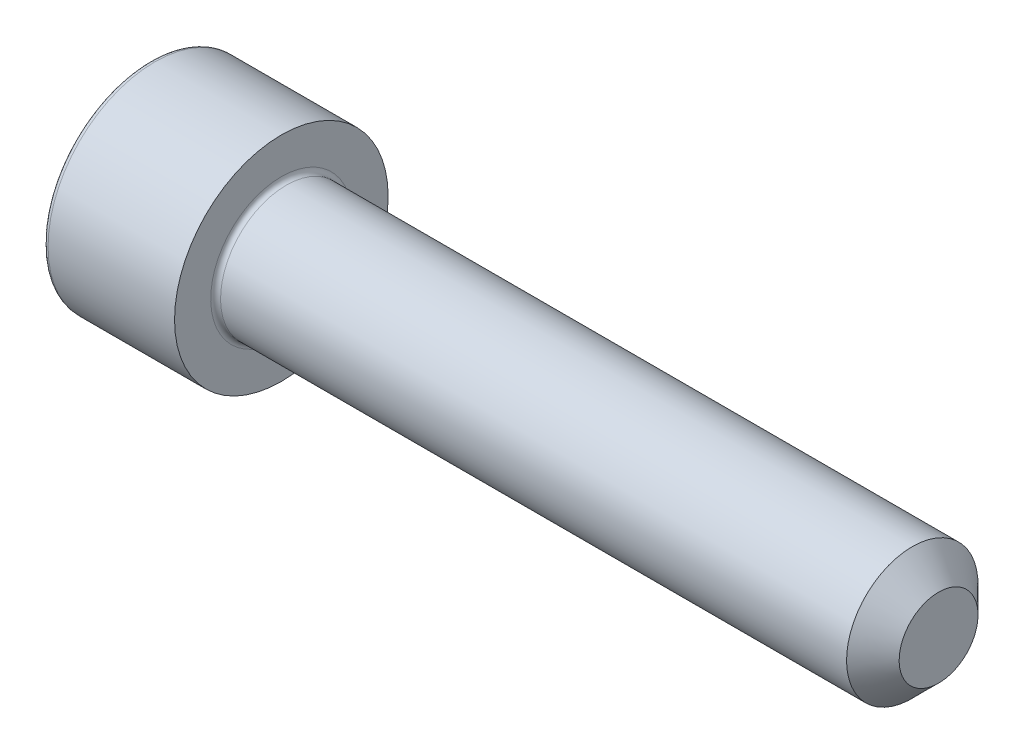
ISO-10303-21;
HEADER;
FILE_DESCRIPTION(('STEP AP214'),'2;1');
FILE_NAME('part.step','',(''),(''),'','','');
FILE_SCHEMA(('AUTOMOTIVE_DESIGN { 1 0 10303 214 1 1 1 1 }'));
ENDSEC;
DATA;
#1=APPLICATION_CONTEXT('core data for automotive mechanical design processes');
#2=APPLICATION_PROTOCOL_DEFINITION('international standard','automotive_design',2000,#1);
#3=PRODUCT_CONTEXT('',#1,'mechanical');
#4=PRODUCT('Part','Part','',(#3));
#5=PRODUCT_RELATED_PRODUCT_CATEGORY('part','',(#4));
#6=PRODUCT_DEFINITION_FORMATION('','',#4);
#7=PRODUCT_DEFINITION_CONTEXT('part definition',#1,'design');
#8=PRODUCT_DEFINITION('design','',#6,#7);
#9=PRODUCT_DEFINITION_SHAPE('','',#8);
#10=(LENGTH_UNIT() NAMED_UNIT(*) SI_UNIT(.MILLI.,.METRE.));
#11=(NAMED_UNIT(*) PLANE_ANGLE_UNIT() SI_UNIT($,.RADIAN.));
#12=(NAMED_UNIT(*) SI_UNIT($,.STERADIAN.) SOLID_ANGLE_UNIT());
#13=UNCERTAINTY_MEASURE_WITH_UNIT(LENGTH_MEASURE(1.E-05),#10,'distance_accuracy_value','');
#14=(GEOMETRIC_REPRESENTATION_CONTEXT(3) GLOBAL_UNCERTAINTY_ASSIGNED_CONTEXT((#13)) GLOBAL_UNIT_ASSIGNED_CONTEXT((#10,
#11,#12)) REPRESENTATION_CONTEXT('',''));
#15=CARTESIAN_POINT('',(0.,0.,0.));
#16=DIRECTION('',(0.,0.,1.));
#17=DIRECTION('',(1.,0.,0.));
#18=AXIS2_PLACEMENT_3D('',#15,#16,#17);
#19=CARTESIAN_POINT('',(0.,0.,0.));
#20=DIRECTION('',(-1.,0.,0.));
#21=DIRECTION('',(0.,-1.,0.));
#22=AXIS2_PLACEMENT_3D('',#19,#20,#21);
#23=PLANE('',#22);
#24=CARTESIAN_POINT('',(0.,0.,0.));
#25=DIRECTION('',(-1.,0.,0.));
#26=DIRECTION('',(0.,-1.,0.));
#27=AXIS2_PLACEMENT_3D('',#24,#25,#26);
#28=CIRCLE('',#27,6.2);
#29=CARTESIAN_POINT('',(0.,-6.2,0.));
#30=VERTEX_POINT('',#29);
#31=EDGE_CURVE('E158',#30,#30,#28,.T.);
#32=ORIENTED_EDGE('',*,*,#31,.T.);
#33=EDGE_LOOP('',(#32));
#34=FACE_BOUND('',#33,.T.);
#35=DIRECTION('',(0.,0.,-1.));
#36=VECTOR('',#35,1.);
#37=CARTESIAN_POINT('',(0.,3.,1.73205080756888));
#38=LINE('',#37,#36);
#39=CARTESIAN_POINT('',(0.,3.,1.73205080756888));
#40=VERTEX_POINT('',#39);
#41=CARTESIAN_POINT('',(0.,3.,-1.73205080756888));
#42=VERTEX_POINT('',#41);
#43=EDGE_CURVE('E54',#40,#42,#38,.T.);
#44=ORIENTED_EDGE('',*,*,#43,.F.);
#45=DIRECTION('',(0.,0.866025403784439,-0.5));
#46=VECTOR('',#45,1.);
#47=CARTESIAN_POINT('',(0.,0.,3.46410161513775));
#48=LINE('',#47,#46);
#49=CARTESIAN_POINT('',(0.,0.,3.46410161513775));
#50=VERTEX_POINT('',#49);
#51=EDGE_CURVE('E137',#50,#40,#48,.T.);
#52=ORIENTED_EDGE('',*,*,#51,.F.);
#53=DIRECTION('',(0.,0.866025403784439,0.5));
#54=VECTOR('',#53,1.);
#55=CARTESIAN_POINT('',(0.,-3.,1.73205080756888));
#56=LINE('',#55,#54);
#57=CARTESIAN_POINT('',(0.,-3.,1.73205080756888));
#58=VERTEX_POINT('',#57);
#59=EDGE_CURVE('E135',#58,#50,#56,.T.);
#60=ORIENTED_EDGE('',*,*,#59,.F.);
#61=DIRECTION('',(0.,0.,1.));
#62=VECTOR('',#61,1.);
#63=CARTESIAN_POINT('',(0.,-3.,-1.73205080756888));
#64=LINE('',#63,#62);
#65=CARTESIAN_POINT('',(0.,-3.,-1.73205080756888));
#66=VERTEX_POINT('',#65);
#67=EDGE_CURVE('E102',#66,#58,#64,.T.);
#68=ORIENTED_EDGE('',*,*,#67,.F.);
#69=DIRECTION('',(0.,-0.866025403784439,0.5));
#70=VECTOR('',#69,1.);
#71=CARTESIAN_POINT('',(0.,0.,-3.46410161513775));
#72=LINE('',#71,#70);
#73=CARTESIAN_POINT('',(0.,0.,-3.46410161513775));
#74=VERTEX_POINT('',#73);
#75=EDGE_CURVE('E131',#74,#66,#72,.T.);
#76=ORIENTED_EDGE('',*,*,#75,.F.);
#77=DIRECTION('',(0.,-0.866025403784438,-0.5));
#78=VECTOR('',#77,1.);
#79=CARTESIAN_POINT('',(0.,3.,-1.73205080756888));
#80=LINE('',#79,#78);
#81=EDGE_CURVE('E128',#42,#74,#80,.T.);
#82=ORIENTED_EDGE('',*,*,#81,.F.);
#83=EDGE_LOOP('',(#44,#52,#60,#68,#76,#82));
#84=FACE_BOUND('',#83,.T.);
#85=ADVANCED_FACE('F38',(#34,#84),#23,.T.);
#86=CARTESIAN_POINT('',(48.,0.,0.));
#87=DIRECTION('',(1.,0.,0.));
#88=DIRECTION('',(0.,1.,0.));
#89=AXIS2_PLACEMENT_3D('',#86,#87,#88);
#90=CYLINDRICAL_SURFACE('',#89,6.5);
#91=CARTESIAN_POINT('',(0.300000000000002,0.,0.));
#92=DIRECTION('',(-1.,0.,0.));
#93=DIRECTION('',(0.,-1.,0.));
#94=AXIS2_PLACEMENT_3D('',#91,#92,#93);
#95=CIRCLE('',#94,6.5);
#96=CARTESIAN_POINT('',(0.300000000000003,-6.5,0.));
#97=VERTEX_POINT('',#96);
#98=EDGE_CURVE('E155',#97,#97,#95,.F.);
#99=ORIENTED_EDGE('',*,*,#98,.T.);
#100=EDGE_LOOP('',(#99));
#101=FACE_BOUND('',#100,.T.);
#102=CARTESIAN_POINT('',(8.,0.,0.));
#103=DIRECTION('',(1.,0.,0.));
#104=DIRECTION('',(0.,1.,0.));
#105=AXIS2_PLACEMENT_3D('',#102,#103,#104);
#106=CIRCLE('',#105,6.49999999999999);
#107=CARTESIAN_POINT('',(8.,6.5,0.));
#108=VERTEX_POINT('',#107);
#109=EDGE_CURVE('E141',#108,#108,#106,.T.);
#110=ORIENTED_EDGE('',*,*,#109,.F.);
#111=EDGE_LOOP('',(#110));
#112=FACE_BOUND('',#111,.T.);
#113=ADVANCED_FACE('F175',(#101,#112),#90,.T.);
#114=CARTESIAN_POINT('',(8.,6.5,0.));
#115=DIRECTION('',(1.,0.,0.));
#116=DIRECTION('',(0.,1.,0.));
#117=AXIS2_PLACEMENT_3D('',#114,#115,#116);
#118=PLANE('',#117);
#119=CARTESIAN_POINT('',(8.,0.,0.));
#120=DIRECTION('',(1.,0.,0.));
#121=DIRECTION('',(0.,1.,0.));
#122=AXIS2_PLACEMENT_3D('',#119,#120,#121);
#123=CIRCLE('',#122,4.29999999999999);
#124=CARTESIAN_POINT('',(8.,4.29999999999999,0.));
#125=VERTEX_POINT('',#124);
#126=EDGE_CURVE('E152',#125,#125,#123,.F.);
#127=ORIENTED_EDGE('',*,*,#126,.T.);
#128=EDGE_LOOP('',(#127));
#129=FACE_BOUND('',#128,.T.);
#130=ORIENTED_EDGE('',*,*,#109,.T.);
#131=EDGE_LOOP('',(#130));
#132=FACE_BOUND('',#131,.T.);
#133=ADVANCED_FACE('F181',(#129,#132),#118,.T.);
#134=CARTESIAN_POINT('',(48.,0.,0.));
#135=DIRECTION('',(1.,0.,0.));
#136=DIRECTION('',(0.,1.,0.));
#137=AXIS2_PLACEMENT_3D('',#134,#135,#136);
#138=CYLINDRICAL_SURFACE('',#137,3.99999999999999);
#139=CARTESIAN_POINT('',(46.4,0.,0.));
#140=DIRECTION('',(1.,0.,0.));
#141=DIRECTION('',(0.,1.,0.));
#142=AXIS2_PLACEMENT_3D('',#139,#140,#141);
#143=CIRCLE('',#142,3.99999999999999);
#144=CARTESIAN_POINT('',(46.4,4.,0.));
#145=VERTEX_POINT('',#144);
#146=EDGE_CURVE('E11',#145,#145,#143,.F.);
#147=ORIENTED_EDGE('',*,*,#146,.T.);
#148=EDGE_LOOP('',(#147));
#149=FACE_BOUND('',#148,.T.);
#150=CARTESIAN_POINT('',(8.3,0.,0.));
#151=DIRECTION('',(1.,0.,0.));
#152=DIRECTION('',(0.,1.,0.));
#153=AXIS2_PLACEMENT_3D('',#150,#151,#152);
#154=CIRCLE('',#153,3.99999999999999);
#155=CARTESIAN_POINT('',(8.3,3.99999999999999,0.));
#156=VERTEX_POINT('',#155);
#157=EDGE_CURVE('E149',#156,#156,#154,.T.);
#158=ORIENTED_EDGE('',*,*,#157,.T.);
#159=EDGE_LOOP('',(#158));
#160=FACE_BOUND('',#159,.T.);
#161=ADVANCED_FACE('F198',(#149,#160),#138,.T.);
#162=CARTESIAN_POINT('',(48.,4.,0.));
#163=DIRECTION('',(1.,0.,0.));
#164=DIRECTION('',(0.,1.,0.));
#165=AXIS2_PLACEMENT_3D('',#162,#163,#164);
#166=PLANE('',#165);
#167=CARTESIAN_POINT('',(48.,0.,0.));
#168=DIRECTION('',(1.,0.,0.));
#169=DIRECTION('',(0.,1.,0.));
#170=AXIS2_PLACEMENT_3D('',#167,#168,#169);
#171=CIRCLE('',#170,2.39999999999999);
#172=CARTESIAN_POINT('',(48.,2.4,0.));
#173=VERTEX_POINT('',#172);
#174=EDGE_CURVE('E47',#173,#173,#171,.T.);
#175=ORIENTED_EDGE('',*,*,#174,.T.);
#176=EDGE_LOOP('',(#175));
#177=FACE_BOUND('',#176,.T.);
#178=ADVANCED_FACE('F163',(#177),#166,.T.);
#179=CARTESIAN_POINT('',(2.5,3.,1.73205080756888));
#180=DIRECTION('',(0.,1.,0.));
#181=DIRECTION('',(-1.,0.,0.));
#182=AXIS2_PLACEMENT_3D('',#179,#180,#181);
#183=PLANE('',#182);
#184=ORIENTED_EDGE('',*,*,#43,.T.);
#185=DIRECTION('',(-1.,0.,0.));
#186=VECTOR('',#185,1.);
#187=CARTESIAN_POINT('',(2.5,3.,-1.73205080756888));
#188=LINE('',#187,#186);
#189=CARTESIAN_POINT('',(2.5,3.,-1.73205080756888));
#190=VERTEX_POINT('',#189);
#191=EDGE_CURVE('E84',#190,#42,#188,.T.);
#192=ORIENTED_EDGE('',*,*,#191,.F.);
#193=DIRECTION('',(0.,0.,-1.));
#194=VECTOR('',#193,1.);
#195=CARTESIAN_POINT('',(2.5,3.,1.73205080756888));
#196=LINE('',#195,#194);
#197=CARTESIAN_POINT('',(2.5,3.,1.73205080756888));
#198=VERTEX_POINT('',#197);
#199=EDGE_CURVE('E139',#198,#190,#196,.T.);
#200=ORIENTED_EDGE('',*,*,#199,.F.);
#201=DIRECTION('',(-1.,0.,0.));
#202=VECTOR('',#201,1.);
#203=CARTESIAN_POINT('',(2.5,3.,1.73205080756888));
#204=LINE('',#203,#202);
#205=EDGE_CURVE('E62',#198,#40,#204,.T.);
#206=ORIENTED_EDGE('',*,*,#205,.T.);
#207=EDGE_LOOP('',(#184,#192,#200,#206));
#208=FACE_BOUND('',#207,.T.);
#209=ADVANCED_FACE('F206',(#208),#183,.F.);
#210=CARTESIAN_POINT('',(2.5,0.,3.46410161513775));
#211=DIRECTION('',(0.,0.5,0.866025403784439));
#212=DIRECTION('',(0.,-0.866025403784439,0.5));
#213=AXIS2_PLACEMENT_3D('',#210,#211,#212);
#214=PLANE('',#213);
#215=ORIENTED_EDGE('',*,*,#51,.T.);
#216=ORIENTED_EDGE('',*,*,#205,.F.);
#217=DIRECTION('',(0.,0.866025403784439,-0.5));
#218=VECTOR('',#217,1.);
#219=CARTESIAN_POINT('',(2.5,0.,3.46410161513775));
#220=LINE('',#219,#218);
#221=CARTESIAN_POINT('',(2.5,0.,3.46410161513775));
#222=VERTEX_POINT('',#221);
#223=EDGE_CURVE('E114',#222,#198,#220,.T.);
#224=ORIENTED_EDGE('',*,*,#223,.F.);
#225=DIRECTION('',(-1.,0.,0.));
#226=VECTOR('',#225,1.);
#227=CARTESIAN_POINT('',(2.5,0.,3.46410161513775));
#228=LINE('',#227,#226);
#229=EDGE_CURVE('E106',#222,#50,#228,.T.);
#230=ORIENTED_EDGE('',*,*,#229,.T.);
#231=EDGE_LOOP('',(#215,#216,#224,#230));
#232=FACE_BOUND('',#231,.T.);
#233=ADVANCED_FACE('F212',(#232),#214,.F.);
#234=CARTESIAN_POINT('',(2.5,-3.,1.73205080756888));
#235=DIRECTION('',(0.,-0.5,0.866025403784439));
#236=DIRECTION('',(0.,-0.866025403784439,-0.5));
#237=AXIS2_PLACEMENT_3D('',#234,#235,#236);
#238=PLANE('',#237);
#239=ORIENTED_EDGE('',*,*,#59,.T.);
#240=ORIENTED_EDGE('',*,*,#229,.F.);
#241=DIRECTION('',(0.,0.866025403784439,0.5));
#242=VECTOR('',#241,1.);
#243=CARTESIAN_POINT('',(2.5,-3.,1.73205080756888));
#244=LINE('',#243,#242);
#245=CARTESIAN_POINT('',(2.5,-3.,1.73205080756888));
#246=VERTEX_POINT('',#245);
#247=EDGE_CURVE('E110',#246,#222,#244,.T.);
#248=ORIENTED_EDGE('',*,*,#247,.F.);
#249=DIRECTION('',(-1.,0.,0.));
#250=VECTOR('',#249,1.);
#251=CARTESIAN_POINT('',(2.5,-3.,1.73205080756888));
#252=LINE('',#251,#250);
#253=EDGE_CURVE('E95',#246,#58,#252,.T.);
#254=ORIENTED_EDGE('',*,*,#253,.T.);
#255=EDGE_LOOP('',(#239,#240,#248,#254));
#256=FACE_BOUND('',#255,.T.);
#257=ADVANCED_FACE('F111',(#256),#238,.F.);
#258=CARTESIAN_POINT('',(2.5,-3.,-1.73205080756888));
#259=DIRECTION('',(0.,-1.,0.));
#260=DIRECTION('',(0.,0.,-1.));
#261=AXIS2_PLACEMENT_3D('',#258,#259,#260);
#262=PLANE('',#261);
#263=ORIENTED_EDGE('',*,*,#67,.T.);
#264=ORIENTED_EDGE('',*,*,#253,.F.);
#265=DIRECTION('',(0.,0.,1.));
#266=VECTOR('',#265,1.);
#267=CARTESIAN_POINT('',(2.5,-3.,-1.73205080756888));
#268=LINE('',#267,#266);
#269=CARTESIAN_POINT('',(2.5,-3.,-1.73205080756888));
#270=VERTEX_POINT('',#269);
#271=EDGE_CURVE('E99',#270,#246,#268,.T.);
#272=ORIENTED_EDGE('',*,*,#271,.F.);
#273=DIRECTION('',(-1.,0.,0.));
#274=VECTOR('',#273,1.);
#275=CARTESIAN_POINT('',(2.5,-3.,-1.73205080756888));
#276=LINE('',#275,#274);
#277=EDGE_CURVE('E107',#270,#66,#276,.T.);
#278=ORIENTED_EDGE('',*,*,#277,.T.);
#279=EDGE_LOOP('',(#263,#264,#272,#278));
#280=FACE_BOUND('',#279,.T.);
#281=ADVANCED_FACE('F97',(#280),#262,.F.);
#282=CARTESIAN_POINT('',(2.5,0.,-3.46410161513775));
#283=DIRECTION('',(0.,-0.5,-0.866025403784439));
#284=DIRECTION('',(0.,0.866025403784439,-0.5));
#285=AXIS2_PLACEMENT_3D('',#282,#283,#284);
#286=PLANE('',#285);
#287=ORIENTED_EDGE('',*,*,#75,.T.);
#288=ORIENTED_EDGE('',*,*,#277,.F.);
#289=DIRECTION('',(0.,-0.866025403784439,0.5));
#290=VECTOR('',#289,1.);
#291=CARTESIAN_POINT('',(2.5,0.,-3.46410161513775));
#292=LINE('',#291,#290);
#293=CARTESIAN_POINT('',(2.5,0.,-3.46410161513775));
#294=VERTEX_POINT('',#293);
#295=EDGE_CURVE('E120',#294,#270,#292,.T.);
#296=ORIENTED_EDGE('',*,*,#295,.F.);
#297=DIRECTION('',(-1.,0.,0.));
#298=VECTOR('',#297,1.);
#299=CARTESIAN_POINT('',(2.5,0.,-3.46410161513775));
#300=LINE('',#299,#298);
#301=EDGE_CURVE('E144',#294,#74,#300,.T.);
#302=ORIENTED_EDGE('',*,*,#301,.T.);
#303=EDGE_LOOP('',(#287,#288,#296,#302));
#304=FACE_BOUND('',#303,.T.);
#305=ADVANCED_FACE('F215',(#304),#286,.F.);
#306=CARTESIAN_POINT('',(2.5,3.,-1.73205080756888));
#307=DIRECTION('',(0.,0.5,-0.866025403784439));
#308=DIRECTION('',(0.,0.866025403784439,0.5));
#309=AXIS2_PLACEMENT_3D('',#306,#307,#308);
#310=PLANE('',#309);
#311=ORIENTED_EDGE('',*,*,#81,.T.);
#312=ORIENTED_EDGE('',*,*,#301,.F.);
#313=DIRECTION('',(0.,-0.866025403784438,-0.5));
#314=VECTOR('',#313,1.);
#315=CARTESIAN_POINT('',(2.5,3.,-1.73205080756888));
#316=LINE('',#315,#314);
#317=EDGE_CURVE('E122',#190,#294,#316,.T.);
#318=ORIENTED_EDGE('',*,*,#317,.F.);
#319=ORIENTED_EDGE('',*,*,#191,.T.);
#320=EDGE_LOOP('',(#311,#312,#318,#319));
#321=FACE_BOUND('',#320,.T.);
#322=ADVANCED_FACE('F192',(#321),#310,.F.);
#323=CARTESIAN_POINT('',(2.5,0.,0.));
#324=DIRECTION('',(-1.,0.,0.));
#325=DIRECTION('',(0.,-1.,0.));
#326=AXIS2_PLACEMENT_3D('',#323,#324,#325);
#327=PLANE('',#326);
#328=ORIENTED_EDGE('',*,*,#199,.T.);
#329=ORIENTED_EDGE('',*,*,#317,.T.);
#330=ORIENTED_EDGE('',*,*,#295,.T.);
#331=ORIENTED_EDGE('',*,*,#271,.T.);
#332=ORIENTED_EDGE('',*,*,#247,.T.);
#333=ORIENTED_EDGE('',*,*,#223,.T.);
#334=EDGE_LOOP('',(#328,#329,#330,#331,#332,#333));
#335=FACE_BOUND('',#334,.T.);
#336=ADVANCED_FACE('F117',(#335),#327,.T.);
#337=CARTESIAN_POINT('',(8.3,0.,0.));
#338=DIRECTION('',(1.,0.,0.));
#339=DIRECTION('',(0.,1.,0.));
#340=AXIS2_PLACEMENT_3D('',#337,#338,#339);
#341=TOROIDAL_SURFACE('',#340,4.29999999999999,0.3);
#342=ORIENTED_EDGE('',*,*,#126,.F.);
#343=EDGE_LOOP('',(#342));
#344=FACE_BOUND('',#343,.T.);
#345=ORIENTED_EDGE('',*,*,#157,.F.);
#346=EDGE_LOOP('',(#345));
#347=FACE_BOUND('',#346,.T.);
#348=ADVANCED_FACE('F171',(#344,#347),#341,.F.);
#349=CARTESIAN_POINT('',(0.300000000000002,0.,0.));
#350=DIRECTION('',(-1.,0.,0.));
#351=DIRECTION('',(0.,-1.,0.));
#352=AXIS2_PLACEMENT_3D('',#349,#350,#351);
#353=TOROIDAL_SURFACE('',#352,6.2,0.3);
#354=ORIENTED_EDGE('',*,*,#31,.F.);
#355=EDGE_LOOP('',(#354));
#356=FACE_BOUND('',#355,.T.);
#357=ORIENTED_EDGE('',*,*,#98,.F.);
#358=EDGE_LOOP('',(#357));
#359=FACE_BOUND('',#358,.T.);
#360=ADVANCED_FACE('F166',(#356,#359),#353,.T.);
#361=CARTESIAN_POINT('',(48.,0.,0.));
#362=DIRECTION('',(-1.,0.,0.));
#363=DIRECTION('',(0.,-1.,0.));
#364=AXIS2_PLACEMENT_3D('',#361,#362,#363);
#365=CONICAL_SURFACE('',#364,2.39999999999999,0.785398163397448);
#366=ORIENTED_EDGE('',*,*,#146,.F.);
#367=EDGE_LOOP('',(#366));
#368=FACE_BOUND('',#367,.T.);
#369=ORIENTED_EDGE('',*,*,#174,.F.);
#370=EDGE_LOOP('',(#369));
#371=FACE_BOUND('',#370,.T.);
#372=ADVANCED_FACE('F41',(#368,#371),#365,.T.);
#373=CLOSED_SHELL('',(#85,#113,#133,#161,#178,#209,#233,#257,#281,#305,#322,#336,#348,#360,#372));
#374=MANIFOLD_SOLID_BREP('B2',#373);
#375=ADVANCED_BREP_SHAPE_REPRESENTATION('',(#18,#374),#14);
#376=SHAPE_DEFINITION_REPRESENTATION(#9,#375);
ENDSEC;
END-ISO-10303-21;
